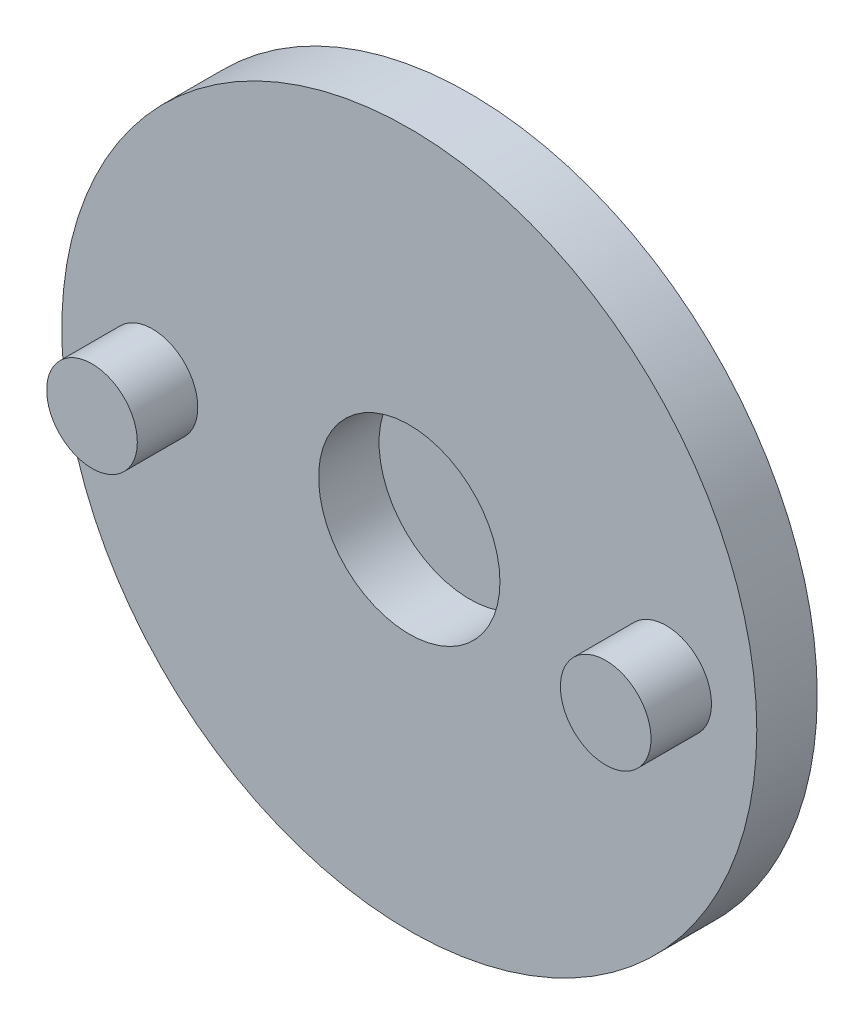
ISO-10303-21;
HEADER;
FILE_DESCRIPTION(('STEP AP214'),'2;1');
FILE_NAME('part.step','',(''),(''),'','','');
FILE_SCHEMA(('AUTOMOTIVE_DESIGN { 1 0 10303 214 1 1 1 1 }'));
ENDSEC;
DATA;
#1=APPLICATION_CONTEXT('core data for automotive mechanical design processes');
#2=APPLICATION_PROTOCOL_DEFINITION('international standard','automotive_design',2000,#1);
#3=PRODUCT_CONTEXT('',#1,'mechanical');
#4=PRODUCT('Part','Part','',(#3));
#5=PRODUCT_RELATED_PRODUCT_CATEGORY('part','',(#4));
#6=PRODUCT_DEFINITION_FORMATION('','',#4);
#7=PRODUCT_DEFINITION_CONTEXT('part definition',#1,'design');
#8=PRODUCT_DEFINITION('design','',#6,#7);
#9=PRODUCT_DEFINITION_SHAPE('','',#8);
#10=(LENGTH_UNIT() NAMED_UNIT(*) SI_UNIT(.MILLI.,.METRE.));
#11=(NAMED_UNIT(*) PLANE_ANGLE_UNIT() SI_UNIT($,.RADIAN.));
#12=(NAMED_UNIT(*) SI_UNIT($,.STERADIAN.) SOLID_ANGLE_UNIT());
#13=UNCERTAINTY_MEASURE_WITH_UNIT(LENGTH_MEASURE(1.E-05),#10,'distance_accuracy_value','');
#14=(GEOMETRIC_REPRESENTATION_CONTEXT(3) GLOBAL_UNCERTAINTY_ASSIGNED_CONTEXT((#13)) GLOBAL_UNIT_ASSIGNED_CONTEXT((#10,
#11,#12)) REPRESENTATION_CONTEXT('',''));
#15=CARTESIAN_POINT('',(0.,0.,0.));
#16=DIRECTION('',(0.,0.,1.));
#17=DIRECTION('',(1.,0.,0.));
#18=AXIS2_PLACEMENT_3D('',#15,#16,#17);
#19=CARTESIAN_POINT('',(0.,0.,8.));
#20=DIRECTION('',(0.,0.,1.));
#21=DIRECTION('',(1.,0.,0.));
#22=AXIS2_PLACEMENT_3D('',#19,#20,#21);
#23=PLANE('',#22);
#24=CARTESIAN_POINT('',(-8.5,0.,8.));
#25=DIRECTION('',(0.,0.,-1.));
#26=DIRECTION('',(1.,0.,0.));
#27=AXIS2_PLACEMENT_3D('',#24,#25,#26);
#28=CIRCLE('',#27,1.5);
#29=CARTESIAN_POINT('',(-7.,0.,8.));
#30=VERTEX_POINT('',#29);
#31=EDGE_CURVE('E11',#30,#30,#28,.T.);
#32=ORIENTED_EDGE('',*,*,#31,.F.);
#33=EDGE_LOOP('',(#32));
#34=FACE_BOUND('',#33,.T.);
#35=ADVANCED_FACE('F17',(#34),#23,.T.);
#36=CARTESIAN_POINT('',(-8.5,0.,8.));
#37=DIRECTION('',(0.,0.,-1.));
#38=DIRECTION('',(-1.,0.,0.));
#39=AXIS2_PLACEMENT_3D('',#36,#37,#38);
#40=CYLINDRICAL_SURFACE('',#39,1.5);
#41=CARTESIAN_POINT('',(-8.5,0.,6.));
#42=DIRECTION('',(0.,0.,1.));
#43=DIRECTION('',(1.,0.,0.));
#44=AXIS2_PLACEMENT_3D('',#41,#42,#43);
#45=CIRCLE('',#44,1.5);
#46=CARTESIAN_POINT('',(-7.,0.,6.));
#47=VERTEX_POINT('',#46);
#48=EDGE_CURVE('E109',#47,#47,#45,.T.);
#49=ORIENTED_EDGE('',*,*,#48,.T.);
#50=EDGE_LOOP('',(#49));
#51=FACE_BOUND('',#50,.T.);
#52=ORIENTED_EDGE('',*,*,#31,.T.);
#53=EDGE_LOOP('',(#52));
#54=FACE_BOUND('',#53,.T.);
#55=ADVANCED_FACE('F141',(#51,#54),#40,.T.);
#56=CARTESIAN_POINT('',(0.,0.,8.));
#57=DIRECTION('',(0.,0.,1.));
#58=DIRECTION('',(1.,0.,0.));
#59=AXIS2_PLACEMENT_3D('',#56,#57,#58);
#60=PLANE('',#59);
#61=CARTESIAN_POINT('',(8.5,0.,8.));
#62=DIRECTION('',(0.,0.,1.));
#63=DIRECTION('',(1.,0.,0.));
#64=AXIS2_PLACEMENT_3D('',#61,#62,#63);
#65=CIRCLE('',#64,1.5);
#66=CARTESIAN_POINT('',(10.,0.,8.));
#67=VERTEX_POINT('',#66);
#68=EDGE_CURVE('E26',#67,#67,#65,.T.);
#69=ORIENTED_EDGE('',*,*,#68,.T.);
#70=EDGE_LOOP('',(#69));
#71=FACE_BOUND('',#70,.T.);
#72=ADVANCED_FACE('F146',(#71),#60,.T.);
#73=CARTESIAN_POINT('',(8.5,0.,8.));
#74=DIRECTION('',(0.,0.,-1.));
#75=DIRECTION('',(-1.,0.,0.));
#76=AXIS2_PLACEMENT_3D('',#73,#74,#75);
#77=CYLINDRICAL_SURFACE('',#76,1.5);
#78=CARTESIAN_POINT('',(8.5,0.,6.));
#79=DIRECTION('',(0.,0.,1.));
#80=DIRECTION('',(1.,0.,0.));
#81=AXIS2_PLACEMENT_3D('',#78,#79,#80);
#82=CIRCLE('',#81,1.5);
#83=CARTESIAN_POINT('',(10.,0.,6.));
#84=VERTEX_POINT('',#83);
#85=EDGE_CURVE('E65',#84,#84,#82,.T.);
#86=ORIENTED_EDGE('',*,*,#85,.T.);
#87=EDGE_LOOP('',(#86));
#88=FACE_BOUND('',#87,.T.);
#89=ORIENTED_EDGE('',*,*,#68,.F.);
#90=EDGE_LOOP('',(#89));
#91=FACE_BOUND('',#90,.T.);
#92=ADVANCED_FACE('F151',(#88,#91),#77,.T.);
#93=CARTESIAN_POINT('',(0.,0.,4.));
#94=DIRECTION('',(0.,0.,1.));
#95=DIRECTION('',(1.,0.,0.));
#96=AXIS2_PLACEMENT_3D('',#93,#94,#95);
#97=PLANE('',#96);
#98=CARTESIAN_POINT('',(0.,0.,4.));
#99=DIRECTION('',(0.,0.,1.));
#100=DIRECTION('',(1.,0.,0.));
#101=AXIS2_PLACEMENT_3D('',#98,#99,#100);
#102=CIRCLE('',#101,3.);
#103=CARTESIAN_POINT('',(3.,0.,4.));
#104=VERTEX_POINT('',#103);
#105=EDGE_CURVE('E96',#104,#104,#102,.T.);
#106=ORIENTED_EDGE('',*,*,#105,.T.);
#107=EDGE_LOOP('',(#106));
#108=FACE_BOUND('',#107,.T.);
#109=ADVANCED_FACE('F155',(#108),#97,.T.);
#110=CARTESIAN_POINT('',(0.,0.,4.));
#111=DIRECTION('',(0.,0.,1.));
#112=DIRECTION('',(1.,0.,0.));
#113=AXIS2_PLACEMENT_3D('',#110,#111,#112);
#114=CYLINDRICAL_SURFACE('',#113,3.);
#115=CARTESIAN_POINT('',(0.,0.,6.));
#116=DIRECTION('',(0.,0.,1.));
#117=DIRECTION('',(1.,0.,0.));
#118=AXIS2_PLACEMENT_3D('',#115,#116,#117);
#119=CIRCLE('',#118,3.);
#120=CARTESIAN_POINT('',(3.,0.,6.));
#121=VERTEX_POINT('',#120);
#122=EDGE_CURVE('E55',#121,#121,#119,.T.);
#123=ORIENTED_EDGE('',*,*,#122,.T.);
#124=EDGE_LOOP('',(#123));
#125=FACE_BOUND('',#124,.T.);
#126=ORIENTED_EDGE('',*,*,#105,.F.);
#127=EDGE_LOOP('',(#126));
#128=FACE_BOUND('',#127,.T.);
#129=ADVANCED_FACE('F157',(#125,#128),#114,.F.);
#130=CARTESIAN_POINT('',(0.,0.,2.));
#131=DIRECTION('',(0.,0.,-1.));
#132=DIRECTION('',(0.,-1.,0.));
#133=AXIS2_PLACEMENT_3D('',#130,#131,#132);
#134=PLANE('',#133);
#135=CARTESIAN_POINT('',(0.,0.,2.));
#136=DIRECTION('',(0.,0.,-1.));
#137=DIRECTION('',(-1.,0.,0.));
#138=AXIS2_PLACEMENT_3D('',#135,#136,#137);
#139=CIRCLE('',#138,3.5);
#140=CARTESIAN_POINT('',(-3.5,0.,2.));
#141=VERTEX_POINT('',#140);
#142=EDGE_CURVE('E102',#141,#141,#139,.T.);
#143=ORIENTED_EDGE('',*,*,#142,.T.);
#144=EDGE_LOOP('',(#143));
#145=FACE_BOUND('',#144,.T.);
#146=ADVANCED_FACE('F163',(#145),#134,.T.);
#147=CARTESIAN_POINT('',(0.,0.,2.));
#148=DIRECTION('',(0.,0.,-1.));
#149=DIRECTION('',(-1.,0.,0.));
#150=AXIS2_PLACEMENT_3D('',#147,#148,#149);
#151=CYLINDRICAL_SURFACE('',#150,3.5);
#152=CARTESIAN_POINT('',(0.,0.,0.));
#153=DIRECTION('',(0.,0.,-1.));
#154=DIRECTION('',(-1.,0.,0.));
#155=AXIS2_PLACEMENT_3D('',#152,#153,#154);
#156=CIRCLE('',#155,3.5);
#157=CARTESIAN_POINT('',(-3.5,0.,0.));
#158=VERTEX_POINT('',#157);
#159=EDGE_CURVE('E93',#158,#158,#156,.T.);
#160=ORIENTED_EDGE('',*,*,#159,.T.);
#161=EDGE_LOOP('',(#160));
#162=FACE_BOUND('',#161,.T.);
#163=ORIENTED_EDGE('',*,*,#142,.F.);
#164=EDGE_LOOP('',(#163));
#165=FACE_BOUND('',#164,.T.);
#166=ADVANCED_FACE('F160',(#162,#165),#151,.F.);
#167=CARTESIAN_POINT('',(0.,0.,4.));
#168=DIRECTION('',(0.,0.,1.));
#169=DIRECTION('',(1.,0.,0.));
#170=AXIS2_PLACEMENT_3D('',#167,#168,#169);
#171=PLANE('',#170);
#172=CARTESIAN_POINT('',(0.,0.,4.));
#173=DIRECTION('',(0.,0.,1.));
#174=DIRECTION('',(1.,0.,0.));
#175=AXIS2_PLACEMENT_3D('',#172,#173,#174);
#176=CIRCLE('',#175,11.5);
#177=CARTESIAN_POINT('',(11.5,0.,4.));
#178=VERTEX_POINT('',#177);
#179=EDGE_CURVE('E107',#178,#178,#176,.T.);
#180=ORIENTED_EDGE('',*,*,#179,.F.);
#181=EDGE_LOOP('',(#180));
#182=FACE_BOUND('',#181,.T.);
#183=CARTESIAN_POINT('',(0.,0.,4.));
#184=DIRECTION('',(0.,0.,1.));
#185=DIRECTION('',(1.,0.,0.));
#186=AXIS2_PLACEMENT_3D('',#183,#184,#185);
#187=CIRCLE('',#186,4.5);
#188=CARTESIAN_POINT('',(4.5,0.,4.));
#189=VERTEX_POINT('',#188);
#190=EDGE_CURVE('E84',#189,#189,#187,.T.);
#191=ORIENTED_EDGE('',*,*,#190,.T.);
#192=EDGE_LOOP('',(#191));
#193=FACE_BOUND('',#192,.T.);
#194=ADVANCED_FACE('F85',(#182,#193),#171,.F.);
#195=CARTESIAN_POINT('',(0.,0.,6.));
#196=DIRECTION('',(0.,0.,1.));
#197=DIRECTION('',(1.,0.,0.));
#198=AXIS2_PLACEMENT_3D('',#195,#196,#197);
#199=PLANE('',#198);
#200=CARTESIAN_POINT('',(0.,0.,6.));
#201=DIRECTION('',(0.,0.,1.));
#202=DIRECTION('',(1.,0.,0.));
#203=AXIS2_PLACEMENT_3D('',#200,#201,#202);
#204=CIRCLE('',#203,11.5);
#205=CARTESIAN_POINT('',(11.5,0.,6.));
#206=VERTEX_POINT('',#205);
#207=EDGE_CURVE('E101',#206,#206,#204,.T.);
#208=ORIENTED_EDGE('',*,*,#207,.T.);
#209=EDGE_LOOP('',(#208));
#210=FACE_BOUND('',#209,.T.);
#211=ORIENTED_EDGE('',*,*,#122,.F.);
#212=EDGE_LOOP('',(#211));
#213=FACE_BOUND('',#212,.T.);
#214=ORIENTED_EDGE('',*,*,#85,.F.);
#215=EDGE_LOOP('',(#214));
#216=FACE_BOUND('',#215,.T.);
#217=ORIENTED_EDGE('',*,*,#48,.F.);
#218=EDGE_LOOP('',(#217));
#219=FACE_BOUND('',#218,.T.);
#220=ADVANCED_FACE('F121',(#210,#213,#216,#219),#199,.T.);
#221=CARTESIAN_POINT('',(0.,0.,6.));
#222=DIRECTION('',(0.,0.,-1.));
#223=DIRECTION('',(-1.,0.,0.));
#224=AXIS2_PLACEMENT_3D('',#221,#222,#223);
#225=CYLINDRICAL_SURFACE('',#224,11.5);
#226=ORIENTED_EDGE('',*,*,#179,.T.);
#227=EDGE_LOOP('',(#226));
#228=FACE_BOUND('',#227,.T.);
#229=ORIENTED_EDGE('',*,*,#207,.F.);
#230=EDGE_LOOP('',(#229));
#231=FACE_BOUND('',#230,.T.);
#232=ADVANCED_FACE('F124',(#228,#231),#225,.T.);
#233=CARTESIAN_POINT('',(0.,0.,0.));
#234=DIRECTION('',(0.,0.,1.));
#235=DIRECTION('',(1.,0.,0.));
#236=AXIS2_PLACEMENT_3D('',#233,#234,#235);
#237=PLANE('',#236);
#238=CARTESIAN_POINT('',(0.,0.,0.));
#239=DIRECTION('',(0.,0.,1.));
#240=DIRECTION('',(1.,0.,0.));
#241=AXIS2_PLACEMENT_3D('',#238,#239,#240);
#242=CIRCLE('',#241,4.5);
#243=CARTESIAN_POINT('',(4.5,0.,0.));
#244=VERTEX_POINT('',#243);
#245=EDGE_CURVE('E88',#244,#244,#242,.T.);
#246=ORIENTED_EDGE('',*,*,#245,.F.);
#247=EDGE_LOOP('',(#246));
#248=FACE_BOUND('',#247,.T.);
#249=ORIENTED_EDGE('',*,*,#159,.F.);
#250=EDGE_LOOP('',(#249));
#251=FACE_BOUND('',#250,.T.);
#252=ADVANCED_FACE('F126',(#248,#251),#237,.F.);
#253=CARTESIAN_POINT('',(0.,0.,4.));
#254=DIRECTION('',(0.,0.,-1.));
#255=DIRECTION('',(-1.,0.,0.));
#256=AXIS2_PLACEMENT_3D('',#253,#254,#255);
#257=CYLINDRICAL_SURFACE('',#256,4.5);
#258=ORIENTED_EDGE('',*,*,#245,.T.);
#259=EDGE_LOOP('',(#258));
#260=FACE_BOUND('',#259,.T.);
#261=ORIENTED_EDGE('',*,*,#190,.F.);
#262=EDGE_LOOP('',(#261));
#263=FACE_BOUND('',#262,.T.);
#264=ADVANCED_FACE('F134',(#260,#263),#257,.T.);
#265=CLOSED_SHELL('',(#35,#55,#72,#92,#109,#129,#146,#166,#194,#220,#232,#252,#264));
#266=MANIFOLD_SOLID_BREP('B1',#265);
#267=ADVANCED_BREP_SHAPE_REPRESENTATION('',(#18,#266),#14);
#268=SHAPE_DEFINITION_REPRESENTATION(#9,#267);
ENDSEC;
END-ISO-10303-21;
